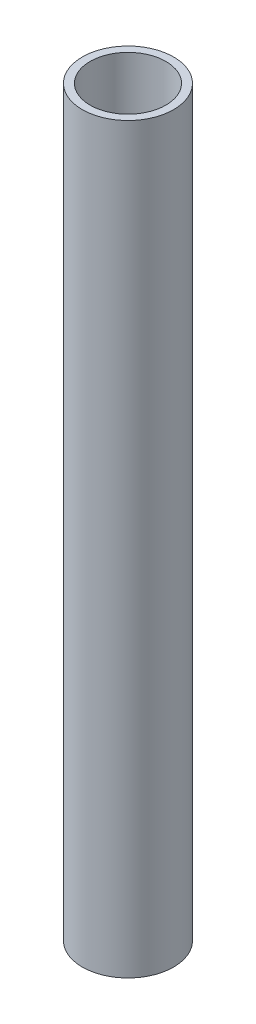
ISO-10303-21;
HEADER;
FILE_DESCRIPTION(('STEP AP214'),'2;1');
FILE_NAME('part.step','',(''),(''),'','','');
FILE_SCHEMA(('AUTOMOTIVE_DESIGN { 1 0 10303 214 1 1 1 1 }'));
ENDSEC;
DATA;
#1=APPLICATION_CONTEXT('core data for automotive mechanical design processes');
#2=APPLICATION_PROTOCOL_DEFINITION('international standard','automotive_design',2000,#1);
#3=PRODUCT_CONTEXT('',#1,'mechanical');
#4=PRODUCT('Part','Part','',(#3));
#5=PRODUCT_RELATED_PRODUCT_CATEGORY('part','',(#4));
#6=PRODUCT_DEFINITION_FORMATION('','',#4);
#7=PRODUCT_DEFINITION_CONTEXT('part definition',#1,'design');
#8=PRODUCT_DEFINITION('design','',#6,#7);
#9=PRODUCT_DEFINITION_SHAPE('','',#8);
#10=(LENGTH_UNIT() NAMED_UNIT(*) SI_UNIT(.MILLI.,.METRE.));
#11=(NAMED_UNIT(*) PLANE_ANGLE_UNIT() SI_UNIT($,.RADIAN.));
#12=(NAMED_UNIT(*) SI_UNIT($,.STERADIAN.) SOLID_ANGLE_UNIT());
#13=UNCERTAINTY_MEASURE_WITH_UNIT(LENGTH_MEASURE(1.E-05),#10,'distance_accuracy_value','');
#14=(GEOMETRIC_REPRESENTATION_CONTEXT(3) GLOBAL_UNCERTAINTY_ASSIGNED_CONTEXT((#13)) GLOBAL_UNIT_ASSIGNED_CONTEXT((#10,
#11,#12)) REPRESENTATION_CONTEXT('',''));
#15=CARTESIAN_POINT('',(0.,0.,0.));
#16=DIRECTION('',(0.,0.,1.));
#17=DIRECTION('',(1.,0.,0.));
#18=AXIS2_PLACEMENT_3D('',#15,#16,#17);
#19=CARTESIAN_POINT('',(0.,342.9,0.));
#20=DIRECTION('',(0.,1.,0.));
#21=DIRECTION('',(0.,0.,1.));
#22=AXIS2_PLACEMENT_3D('',#19,#20,#21);
#23=PLANE('',#22);
#24=CARTESIAN_POINT('',(0.,342.9,0.));
#25=DIRECTION('',(0.,1.,0.));
#26=DIRECTION('',(0.,0.,1.));
#27=AXIS2_PLACEMENT_3D('',#24,#25,#26);
#28=CIRCLE('',#27,21.082);
#29=CARTESIAN_POINT('',(0.,342.9,21.082));
#30=VERTEX_POINT('',#29);
#31=EDGE_CURVE('E10',#30,#30,#28,.T.);
#32=ORIENTED_EDGE('',*,*,#31,.T.);
#33=EDGE_LOOP('',(#32));
#34=FACE_BOUND('',#33,.T.);
#35=CARTESIAN_POINT('',(0.,342.9,0.));
#36=DIRECTION('',(0.,1.,0.));
#37=DIRECTION('',(0.,0.,1.));
#38=AXIS2_PLACEMENT_3D('',#35,#36,#37);
#39=CIRCLE('',#38,17.5006);
#40=CARTESIAN_POINT('',(0.,342.9,17.5006));
#41=VERTEX_POINT('',#40);
#42=EDGE_CURVE('E43',#41,#41,#39,.T.);
#43=ORIENTED_EDGE('',*,*,#42,.F.);
#44=EDGE_LOOP('',(#43));
#45=FACE_BOUND('',#44,.T.);
#46=ADVANCED_FACE('F32',(#34,#45),#23,.T.);
#47=CARTESIAN_POINT('',(0.,0.,0.));
#48=DIRECTION('',(0.,1.,0.));
#49=DIRECTION('',(0.,0.,1.));
#50=AXIS2_PLACEMENT_3D('',#47,#48,#49);
#51=PLANE('',#50);
#52=CARTESIAN_POINT('',(0.,0.,0.));
#53=DIRECTION('',(0.,1.,0.));
#54=DIRECTION('',(0.,0.,1.));
#55=AXIS2_PLACEMENT_3D('',#52,#53,#54);
#56=CIRCLE('',#55,21.082);
#57=CARTESIAN_POINT('',(0.,0.,21.082));
#58=VERTEX_POINT('',#57);
#59=EDGE_CURVE('E36',#58,#58,#56,.T.);
#60=ORIENTED_EDGE('',*,*,#59,.F.);
#61=EDGE_LOOP('',(#60));
#62=FACE_BOUND('',#61,.T.);
#63=CARTESIAN_POINT('',(0.,0.,0.));
#64=DIRECTION('',(0.,1.,0.));
#65=DIRECTION('',(0.,0.,1.));
#66=AXIS2_PLACEMENT_3D('',#63,#64,#65);
#67=CIRCLE('',#66,17.5006);
#68=CARTESIAN_POINT('',(0.,0.,17.5006));
#69=VERTEX_POINT('',#68);
#70=EDGE_CURVE('E45',#69,#69,#67,.T.);
#71=ORIENTED_EDGE('',*,*,#70,.T.);
#72=EDGE_LOOP('',(#71));
#73=FACE_BOUND('',#72,.T.);
#74=ADVANCED_FACE('F55',(#62,#73),#51,.F.);
#75=CARTESIAN_POINT('',(0.,342.9,0.));
#76=DIRECTION('',(0.,-1.,0.));
#77=DIRECTION('',(0.,0.,-1.));
#78=AXIS2_PLACEMENT_3D('',#75,#76,#77);
#79=CYLINDRICAL_SURFACE('',#78,21.082);
#80=ORIENTED_EDGE('',*,*,#31,.F.);
#81=EDGE_LOOP('',(#80));
#82=FACE_BOUND('',#81,.T.);
#83=ORIENTED_EDGE('',*,*,#59,.T.);
#84=EDGE_LOOP('',(#83));
#85=FACE_BOUND('',#84,.T.);
#86=ADVANCED_FACE('F34',(#82,#85),#79,.T.);
#87=CARTESIAN_POINT('',(0.,342.9,0.));
#88=DIRECTION('',(0.,-1.,0.));
#89=DIRECTION('',(0.,0.,-1.));
#90=AXIS2_PLACEMENT_3D('',#87,#88,#89);
#91=CYLINDRICAL_SURFACE('',#90,17.5006);
#92=ORIENTED_EDGE('',*,*,#42,.T.);
#93=EDGE_LOOP('',(#92));
#94=FACE_BOUND('',#93,.T.);
#95=ORIENTED_EDGE('',*,*,#70,.F.);
#96=EDGE_LOOP('',(#95));
#97=FACE_BOUND('',#96,.T.);
#98=ADVANCED_FACE('F51',(#94,#97),#91,.F.);
#99=CLOSED_SHELL('',(#46,#74,#86,#98));
#100=MANIFOLD_SOLID_BREP('B2',#99);
#101=ADVANCED_BREP_SHAPE_REPRESENTATION('',(#18,#100),#14);
#102=SHAPE_DEFINITION_REPRESENTATION(#9,#101);
ENDSEC;
END-ISO-10303-21;
